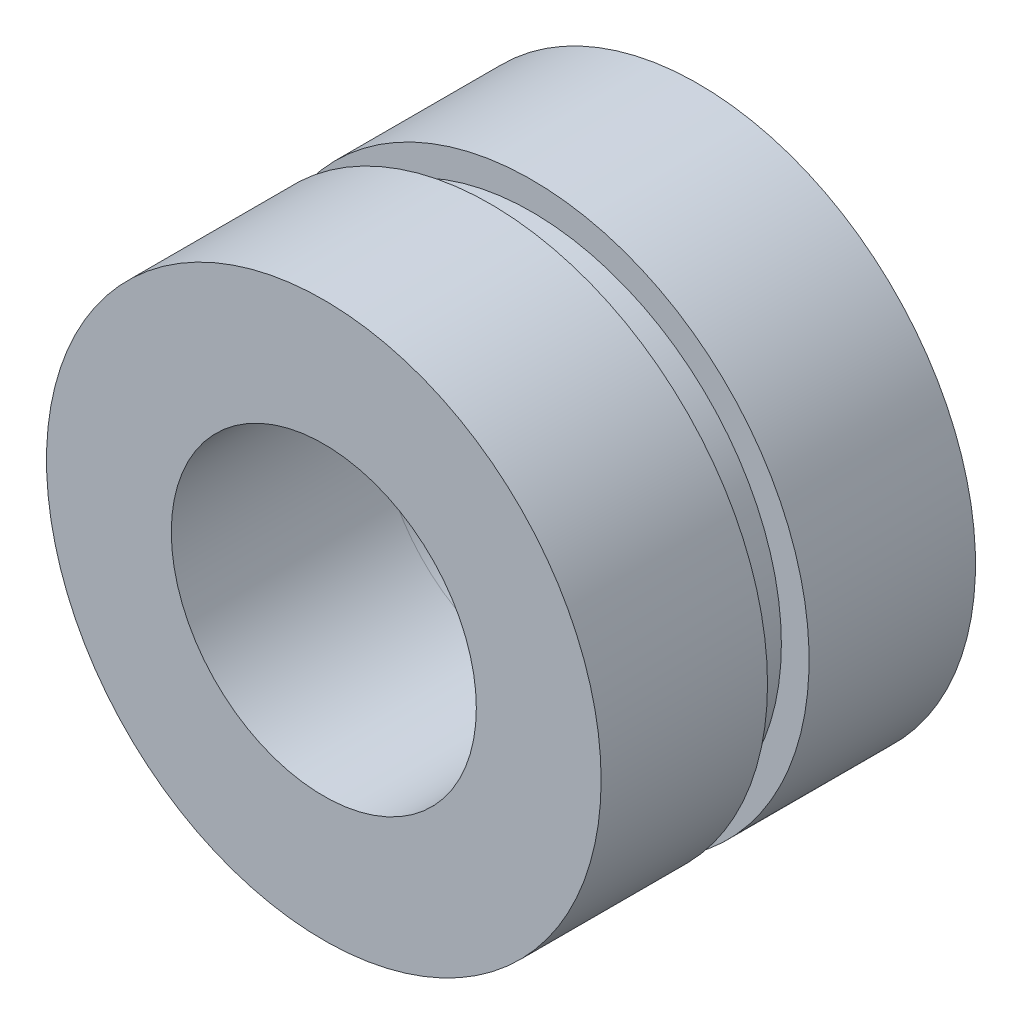
ISO-10303-21;
HEADER;
FILE_DESCRIPTION(('STEP AP214'),'2;1');
FILE_NAME('part.step','',(''),(''),'','','');
FILE_SCHEMA(('AUTOMOTIVE_DESIGN { 1 0 10303 214 1 1 1 1 }'));
ENDSEC;
DATA;
#1=APPLICATION_CONTEXT('core data for automotive mechanical design processes');
#2=APPLICATION_PROTOCOL_DEFINITION('international standard','automotive_design',2000,#1);
#3=PRODUCT_CONTEXT('',#1,'mechanical');
#4=PRODUCT('Part','Part','',(#3));
#5=PRODUCT_RELATED_PRODUCT_CATEGORY('part','',(#4));
#6=PRODUCT_DEFINITION_FORMATION('','',#4);
#7=PRODUCT_DEFINITION_CONTEXT('part definition',#1,'design');
#8=PRODUCT_DEFINITION('design','',#6,#7);
#9=PRODUCT_DEFINITION_SHAPE('','',#8);
#10=(LENGTH_UNIT() NAMED_UNIT(*) SI_UNIT(.MILLI.,.METRE.));
#11=(NAMED_UNIT(*) PLANE_ANGLE_UNIT() SI_UNIT($,.RADIAN.));
#12=(NAMED_UNIT(*) SI_UNIT($,.STERADIAN.) SOLID_ANGLE_UNIT());
#13=UNCERTAINTY_MEASURE_WITH_UNIT(LENGTH_MEASURE(1.E-05),#10,'distance_accuracy_value','');
#14=(GEOMETRIC_REPRESENTATION_CONTEXT(3) GLOBAL_UNCERTAINTY_ASSIGNED_CONTEXT((#13)) GLOBAL_UNIT_ASSIGNED_CONTEXT((#10,
#11,#12)) REPRESENTATION_CONTEXT('',''));
#15=CARTESIAN_POINT('',(0.,0.,0.));
#16=DIRECTION('',(0.,0.,1.));
#17=DIRECTION('',(1.,0.,0.));
#18=AXIS2_PLACEMENT_3D('',#15,#16,#17);
#19=CARTESIAN_POINT('',(0.,0.,-3.048));
#20=DIRECTION('',(0.,0.,-1.));
#21=DIRECTION('',(-1.,0.,0.));
#22=AXIS2_PLACEMENT_3D('',#19,#20,#21);
#23=PLANE('',#22);
#24=CARTESIAN_POINT('',(0.,0.,-3.048));
#25=DIRECTION('',(0.,0.,-1.));
#26=DIRECTION('',(-1.,0.,0.));
#27=AXIS2_PLACEMENT_3D('',#24,#25,#26);
#28=CIRCLE('',#27,5.08);
#29=CARTESIAN_POINT('',(-5.08,0.,-3.048));
#30=VERTEX_POINT('',#29);
#31=EDGE_CURVE('E11',#30,#30,#28,.T.);
#32=ORIENTED_EDGE('',*,*,#31,.T.);
#33=EDGE_LOOP('',(#32));
#34=FACE_BOUND('',#33,.T.);
#35=CARTESIAN_POINT('',(0.,0.,-3.048));
#36=DIRECTION('',(0.,0.,-1.));
#37=DIRECTION('',(-1.,0.,0.));
#38=AXIS2_PLACEMENT_3D('',#35,#36,#37);
#39=CIRCLE('',#38,2.794);
#40=CARTESIAN_POINT('',(-2.794,0.,-3.048));
#41=VERTEX_POINT('',#40);
#42=EDGE_CURVE('E52',#41,#41,#39,.T.);
#43=ORIENTED_EDGE('',*,*,#42,.F.);
#44=EDGE_LOOP('',(#43));
#45=FACE_BOUND('',#44,.T.);
#46=ADVANCED_FACE('F41',(#34,#45),#23,.T.);
#47=CARTESIAN_POINT('',(0.,0.,0.));
#48=DIRECTION('',(0.,0.,-1.));
#49=DIRECTION('',(-1.,0.,0.));
#50=AXIS2_PLACEMENT_3D('',#47,#48,#49);
#51=PLANE('',#50);
#52=CARTESIAN_POINT('',(0.,0.,0.));
#53=DIRECTION('',(0.,0.,-1.));
#54=DIRECTION('',(-1.,0.,0.));
#55=AXIS2_PLACEMENT_3D('',#52,#53,#54);
#56=CIRCLE('',#55,5.08);
#57=CARTESIAN_POINT('',(-5.08,0.,0.));
#58=VERTEX_POINT('',#57);
#59=EDGE_CURVE('E45',#58,#58,#56,.T.);
#60=ORIENTED_EDGE('',*,*,#59,.F.);
#61=EDGE_LOOP('',(#60));
#62=FACE_BOUND('',#61,.T.);
#63=CARTESIAN_POINT('',(0.,0.,0.));
#64=DIRECTION('',(0.,0.,-1.));
#65=DIRECTION('',(-1.,0.,0.));
#66=AXIS2_PLACEMENT_3D('',#63,#64,#65);
#67=CIRCLE('',#66,2.794);
#68=CARTESIAN_POINT('',(-2.794,0.,0.));
#69=VERTEX_POINT('',#68);
#70=EDGE_CURVE('E54',#69,#69,#67,.T.);
#71=ORIENTED_EDGE('',*,*,#70,.T.);
#72=EDGE_LOOP('',(#71));
#73=FACE_BOUND('',#72,.T.);
#74=ADVANCED_FACE('F64',(#62,#73),#51,.F.);
#75=CARTESIAN_POINT('',(0.,0.,-3.048));
#76=DIRECTION('',(0.,0.,1.));
#77=DIRECTION('',(1.,0.,0.));
#78=AXIS2_PLACEMENT_3D('',#75,#76,#77);
#79=CYLINDRICAL_SURFACE('',#78,5.08);
#80=ORIENTED_EDGE('',*,*,#31,.F.);
#81=EDGE_LOOP('',(#80));
#82=FACE_BOUND('',#81,.T.);
#83=ORIENTED_EDGE('',*,*,#59,.T.);
#84=EDGE_LOOP('',(#83));
#85=FACE_BOUND('',#84,.T.);
#86=ADVANCED_FACE('F43',(#82,#85),#79,.T.);
#87=CARTESIAN_POINT('',(0.,0.,-3.048));
#88=DIRECTION('',(0.,0.,1.));
#89=DIRECTION('',(1.,0.,0.));
#90=AXIS2_PLACEMENT_3D('',#87,#88,#89);
#91=CYLINDRICAL_SURFACE('',#90,2.794);
#92=ORIENTED_EDGE('',*,*,#42,.T.);
#93=EDGE_LOOP('',(#92));
#94=FACE_BOUND('',#93,.T.);
#95=ORIENTED_EDGE('',*,*,#70,.F.);
#96=EDGE_LOOP('',(#95));
#97=FACE_BOUND('',#96,.T.);
#98=ADVANCED_FACE('F60',(#94,#97),#91,.F.);
#99=CLOSED_SHELL('',(#46,#74,#86,#98));
#100=MANIFOLD_SOLID_BREP('B2',#99);
#101=CARTESIAN_POINT('',(0.,0.,0.));
#102=DIRECTION('',(0.,0.,1.));
#103=DIRECTION('',(1.,0.,0.));
#104=AXIS2_PLACEMENT_3D('',#101,#102,#103);
#105=PLANE('',#104);
#106=CARTESIAN_POINT('',(0.,0.,0.));
#107=DIRECTION('',(0.,0.,1.));
#108=DIRECTION('',(1.,0.,0.));
#109=AXIS2_PLACEMENT_3D('',#106,#107,#108);
#110=CIRCLE('',#109,4.572);
#111=CARTESIAN_POINT('',(4.572,0.,0.));
#112=VERTEX_POINT('',#111);
#113=EDGE_CURVE('E107',#112,#112,#110,.T.);
#114=ORIENTED_EDGE('',*,*,#113,.F.);
#115=EDGE_LOOP('',(#114));
#116=FACE_BOUND('',#115,.T.);
#117=CARTESIAN_POINT('',(0.,0.,0.));
#118=DIRECTION('',(0.,0.,1.));
#119=DIRECTION('',(1.,0.,0.));
#120=AXIS2_PLACEMENT_3D('',#117,#118,#119);
#121=CIRCLE('',#120,2.794);
#122=CARTESIAN_POINT('',(2.794,0.,0.));
#123=VERTEX_POINT('',#122);
#124=EDGE_CURVE('E114',#123,#123,#121,.T.);
#125=ORIENTED_EDGE('',*,*,#124,.T.);
#126=EDGE_LOOP('',(#125));
#127=FACE_BOUND('',#126,.T.);
#128=ADVANCED_FACE('F103',(#116,#127),#105,.F.);
#129=CARTESIAN_POINT('',(0.,0.,0.762));
#130=DIRECTION('',(0.,0.,-1.));
#131=DIRECTION('',(-1.,0.,0.));
#132=AXIS2_PLACEMENT_3D('',#129,#130,#131);
#133=CYLINDRICAL_SURFACE('',#132,4.572);
#134=CARTESIAN_POINT('',(0.,0.,0.762));
#135=DIRECTION('',(0.,0.,1.));
#136=DIRECTION('',(1.,0.,0.));
#137=AXIS2_PLACEMENT_3D('',#134,#135,#136);
#138=CIRCLE('',#137,4.572);
#139=CARTESIAN_POINT('',(4.572,0.,0.762));
#140=VERTEX_POINT('',#139);
#141=EDGE_CURVE('E40',#140,#140,#138,.T.);
#142=ORIENTED_EDGE('',*,*,#141,.F.);
#143=EDGE_LOOP('',(#142));
#144=FACE_BOUND('',#143,.T.);
#145=ORIENTED_EDGE('',*,*,#113,.T.);
#146=EDGE_LOOP('',(#145));
#147=FACE_BOUND('',#146,.T.);
#148=ADVANCED_FACE('F105',(#144,#147),#133,.T.);
#149=CARTESIAN_POINT('',(0.,0.,0.762));
#150=DIRECTION('',(0.,0.,-1.));
#151=DIRECTION('',(-1.,0.,0.));
#152=AXIS2_PLACEMENT_3D('',#149,#150,#151);
#153=CYLINDRICAL_SURFACE('',#152,2.794);
#154=ORIENTED_EDGE('',*,*,#124,.F.);
#155=EDGE_LOOP('',(#154));
#156=FACE_BOUND('',#155,.T.);
#157=CARTESIAN_POINT('',(0.,0.,3.81));
#158=DIRECTION('',(0.,0.,1.));
#159=DIRECTION('',(1.,0.,0.));
#160=AXIS2_PLACEMENT_3D('',#157,#158,#159);
#161=CIRCLE('',#160,2.794);
#162=CARTESIAN_POINT('',(2.794,0.,3.81));
#163=VERTEX_POINT('',#162);
#164=EDGE_CURVE('E122',#163,#163,#161,.T.);
#165=ORIENTED_EDGE('',*,*,#164,.T.);
#166=EDGE_LOOP('',(#165));
#167=FACE_BOUND('',#166,.T.);
#168=ADVANCED_FACE('F128',(#156,#167),#153,.F.);
#169=CARTESIAN_POINT('',(0.,0.,0.762));
#170=DIRECTION('',(0.,0.,1.));
#171=DIRECTION('',(1.,0.,0.));
#172=AXIS2_PLACEMENT_3D('',#169,#170,#171);
#173=PLANE('',#172);
#174=CARTESIAN_POINT('',(0.,0.,0.762));
#175=DIRECTION('',(0.,0.,1.));
#176=DIRECTION('',(1.,0.,0.));
#177=AXIS2_PLACEMENT_3D('',#174,#175,#176);
#178=CIRCLE('',#177,5.08);
#179=CARTESIAN_POINT('',(5.08,0.,0.762));
#180=VERTEX_POINT('',#179);
#181=EDGE_CURVE('E119',#180,#180,#178,.T.);
#182=ORIENTED_EDGE('',*,*,#181,.F.);
#183=EDGE_LOOP('',(#182));
#184=FACE_BOUND('',#183,.T.);
#185=ORIENTED_EDGE('',*,*,#141,.T.);
#186=EDGE_LOOP('',(#185));
#187=FACE_BOUND('',#186,.T.);
#188=ADVANCED_FACE('F133',(#184,#187),#173,.F.);
#189=CARTESIAN_POINT('',(0.,0.,3.81));
#190=DIRECTION('',(0.,0.,1.));
#191=DIRECTION('',(1.,0.,0.));
#192=AXIS2_PLACEMENT_3D('',#189,#190,#191);
#193=PLANE('',#192);
#194=CARTESIAN_POINT('',(0.,0.,3.81));
#195=DIRECTION('',(0.,0.,1.));
#196=DIRECTION('',(1.,0.,0.));
#197=AXIS2_PLACEMENT_3D('',#194,#195,#196);
#198=CIRCLE('',#197,5.08);
#199=CARTESIAN_POINT('',(5.08,0.,3.81));
#200=VERTEX_POINT('',#199);
#201=EDGE_CURVE('E118',#200,#200,#198,.T.);
#202=ORIENTED_EDGE('',*,*,#201,.T.);
#203=EDGE_LOOP('',(#202));
#204=FACE_BOUND('',#203,.T.);
#205=ORIENTED_EDGE('',*,*,#164,.F.);
#206=EDGE_LOOP('',(#205));
#207=FACE_BOUND('',#206,.T.);
#208=ADVANCED_FACE('F130',(#204,#207),#193,.T.);
#209=CARTESIAN_POINT('',(0.,0.,3.81));
#210=DIRECTION('',(0.,0.,-1.));
#211=DIRECTION('',(-1.,0.,0.));
#212=AXIS2_PLACEMENT_3D('',#209,#210,#211);
#213=CYLINDRICAL_SURFACE('',#212,5.08);
#214=ORIENTED_EDGE('',*,*,#201,.F.);
#215=EDGE_LOOP('',(#214));
#216=FACE_BOUND('',#215,.T.);
#217=ORIENTED_EDGE('',*,*,#181,.T.);
#218=EDGE_LOOP('',(#217));
#219=FACE_BOUND('',#218,.T.);
#220=ADVANCED_FACE('F132',(#216,#219),#213,.T.);
#221=CLOSED_SHELL('',(#128,#148,#168,#188,#208,#220));
#222=MANIFOLD_SOLID_BREP('B6',#221);
#223=ADVANCED_BREP_SHAPE_REPRESENTATION('',(#18,#100,#222),#14);
#224=SHAPE_DEFINITION_REPRESENTATION(#9,#223);
ENDSEC;
END-ISO-10303-21;
